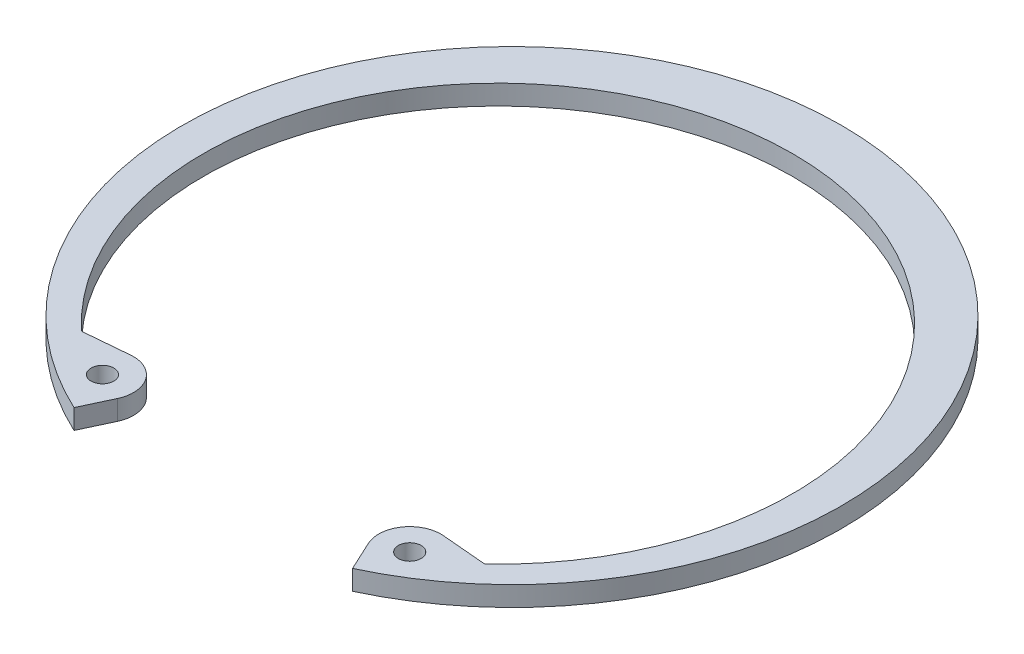
ISO-10303-21;
HEADER;
FILE_DESCRIPTION(('STEP AP214'),'2;1');
FILE_NAME('part.step','',(''),(''),'','','');
FILE_SCHEMA(('AUTOMOTIVE_DESIGN { 1 0 10303 214 1 1 1 1 }'));
ENDSEC;
DATA;
#1=APPLICATION_CONTEXT('core data for automotive mechanical design processes');
#2=APPLICATION_PROTOCOL_DEFINITION('international standard','automotive_design',2000,#1);
#3=PRODUCT_CONTEXT('',#1,'mechanical');
#4=PRODUCT('Part','Part','',(#3));
#5=PRODUCT_RELATED_PRODUCT_CATEGORY('part','',(#4));
#6=PRODUCT_DEFINITION_FORMATION('','',#4);
#7=PRODUCT_DEFINITION_CONTEXT('part definition',#1,'design');
#8=PRODUCT_DEFINITION('design','',#6,#7);
#9=PRODUCT_DEFINITION_SHAPE('','',#8);
#10=(LENGTH_UNIT() NAMED_UNIT(*) SI_UNIT(.MILLI.,.METRE.));
#11=(NAMED_UNIT(*) PLANE_ANGLE_UNIT() SI_UNIT($,.RADIAN.));
#12=(NAMED_UNIT(*) SI_UNIT($,.STERADIAN.) SOLID_ANGLE_UNIT());
#13=UNCERTAINTY_MEASURE_WITH_UNIT(LENGTH_MEASURE(1.E-05),#10,'distance_accuracy_value','');
#14=(GEOMETRIC_REPRESENTATION_CONTEXT(3) GLOBAL_UNCERTAINTY_ASSIGNED_CONTEXT((#13)) GLOBAL_UNIT_ASSIGNED_CONTEXT((#10,
#11,#12)) REPRESENTATION_CONTEXT('',''));
#15=CARTESIAN_POINT('',(0.,0.,0.));
#16=DIRECTION('',(0.,0.,1.));
#17=DIRECTION('',(1.,0.,0.));
#18=AXIS2_PLACEMENT_3D('',#15,#16,#17);
#19=CARTESIAN_POINT('',(21.450481238733,-2.7686,35.7233455084594));
#20=DIRECTION('',(0.,1.,0.));
#21=DIRECTION('',(0.,0.,1.));
#22=AXIS2_PLACEMENT_3D('',#19,#20,#21);
#23=CYLINDRICAL_SURFACE('',#22,4.3434);
#24=CARTESIAN_POINT('',(21.450481238733,0.,35.7233455084594));
#25=DIRECTION('',(0.,1.,0.));
#26=DIRECTION('',(0.,0.,-1.));
#27=AXIS2_PLACEMENT_3D('',#24,#25,#26);
#28=CIRCLE('',#27,4.3434);
#29=CARTESIAN_POINT('',(21.8290334917832,0.,31.3964734567677));
#30=VERTEX_POINT('',#29);
#31=CARTESIAN_POINT('',(17.514023996518,0.,37.5589456665039));
#32=VERTEX_POINT('',#31);
#33=EDGE_CURVE('E160',#30,#32,#28,.T.);
#34=ORIENTED_EDGE('',*,*,#33,.F.);
#35=DIRECTION('',(0.,1.,0.));
#36=VECTOR('',#35,1.);
#37=CARTESIAN_POINT('',(21.8290334917832,-2.7686,31.3964734567677));
#38=LINE('',#37,#36);
#39=CARTESIAN_POINT('',(21.8290334917832,-2.7686,31.3964734567677));
#40=VERTEX_POINT('',#39);
#41=EDGE_CURVE('E137',#40,#30,#38,.T.);
#42=ORIENTED_EDGE('',*,*,#41,.F.);
#43=CARTESIAN_POINT('',(21.450481238733,-2.7686,35.7233455084594));
#44=DIRECTION('',(0.,1.,0.));
#45=DIRECTION('',(0.,0.,-1.));
#46=AXIS2_PLACEMENT_3D('',#43,#44,#45);
#47=CIRCLE('',#46,4.3434);
#48=CARTESIAN_POINT('',(17.514023996518,-2.7686,37.5589456665039));
#49=VERTEX_POINT('',#48);
#50=EDGE_CURVE('E130',#40,#49,#47,.T.);
#51=ORIENTED_EDGE('',*,*,#50,.T.);
#52=DIRECTION('',(0.,1.,0.));
#53=VECTOR('',#52,1.);
#54=CARTESIAN_POINT('',(17.514023996518,-2.7686,37.5589456665039));
#55=LINE('',#54,#53);
#56=EDGE_CURVE('E113',#49,#32,#55,.T.);
#57=ORIENTED_EDGE('',*,*,#56,.T.);
#58=EDGE_LOOP('',(#34,#42,#51,#57));
#59=FACE_BOUND('',#58,.T.);
#60=ADVANCED_FACE('F38',(#59),#23,.T.);
#61=CARTESIAN_POINT('',(28.1520717588371,-2.7686,31.9496676241755));
#62=DIRECTION('',(0.0871557427476625,0.,-0.996194698091745));
#63=DIRECTION('',(-0.996194698091745,0.,-0.0871557427476625));
#64=AXIS2_PLACEMENT_3D('',#61,#62,#63);
#65=PLANE('',#64);
#66=DIRECTION('',(-0.996194698091745,0.,-0.0871557427476625));
#67=VECTOR('',#66,1.);
#68=CARTESIAN_POINT('',(28.1520717588371,0.,31.9496676241755));
#69=LINE('',#68,#67);
#70=CARTESIAN_POINT('',(28.0387108014153,0.,31.9397498255147));
#71=VERTEX_POINT('',#70);
#72=EDGE_CURVE('E138',#71,#30,#69,.T.);
#73=ORIENTED_EDGE('',*,*,#72,.F.);
#74=DIRECTION('',(0.,-1.,0.));
#75=VECTOR('',#74,1.);
#76=CARTESIAN_POINT('',(28.0387108014153,-2.7686,31.9397498255147));
#77=LINE('',#76,#75);
#78=CARTESIAN_POINT('',(28.0387108014153,-2.7686,31.9397498255147));
#79=VERTEX_POINT('',#78);
#80=EDGE_CURVE('E53',#71,#79,#77,.T.);
#81=ORIENTED_EDGE('',*,*,#80,.T.);
#82=DIRECTION('',(-0.996194698091745,0.,-0.0871557427476625));
#83=VECTOR('',#82,1.);
#84=CARTESIAN_POINT('',(28.1520717588371,-2.7686,31.9496676241755));
#85=LINE('',#84,#83);
#86=EDGE_CURVE('E124',#79,#40,#85,.T.);
#87=ORIENTED_EDGE('',*,*,#86,.T.);
#88=ORIENTED_EDGE('',*,*,#41,.T.);
#89=EDGE_LOOP('',(#73,#81,#87,#88));
#90=FACE_BOUND('',#89,.T.);
#91=ADVANCED_FACE('F215',(#90),#65,.T.);
#92=CARTESIAN_POINT('',(0.,-2.7686,1.95621005176375));
#93=DIRECTION('',(0.,1.,0.));
#94=DIRECTION('',(0.,0.,1.));
#95=AXIS2_PLACEMENT_3D('',#92,#93,#94);
#96=CYLINDRICAL_SURFACE('',#95,41.1357100517638);
#97=CARTESIAN_POINT('',(0.,0.,1.95621005176375));
#98=DIRECTION('',(0.,-1.,0.));
#99=DIRECTION('',(0.,0.,1.));
#100=AXIS2_PLACEMENT_3D('',#97,#98,#99);
#101=CIRCLE('',#100,41.1357100517638);
#102=CARTESIAN_POINT('',(-28.2351917394091,0.,31.8714334154891));
#103=VERTEX_POINT('',#102);
#104=CARTESIAN_POINT('',(28.2351917394092,0.,31.8714334154891));
#105=VERTEX_POINT('',#104);
#106=EDGE_CURVE('E140',#103,#105,#101,.T.);
#107=ORIENTED_EDGE('',*,*,#106,.F.);
#108=DIRECTION('',(0.,1.,0.));
#109=VECTOR('',#108,1.);
#110=CARTESIAN_POINT('',(-28.2351917394091,-2.7686,31.8714334154891));
#111=LINE('',#110,#109);
#112=CARTESIAN_POINT('',(-28.2351917394091,-2.7686,31.8714334154891));
#113=VERTEX_POINT('',#112);
#114=EDGE_CURVE('E191',#103,#113,#111,.F.);
#115=ORIENTED_EDGE('',*,*,#114,.T.);
#116=CARTESIAN_POINT('',(0.,-2.7686,1.95621005176375));
#117=DIRECTION('',(0.,-1.,0.));
#118=DIRECTION('',(0.,0.,1.));
#119=AXIS2_PLACEMENT_3D('',#116,#117,#118);
#120=CIRCLE('',#119,41.1357100517638);
#121=CARTESIAN_POINT('',(28.2351917394092,-2.7686,31.8714334154891));
#122=VERTEX_POINT('',#121);
#123=EDGE_CURVE('E156',#113,#122,#120,.T.);
#124=ORIENTED_EDGE('',*,*,#123,.T.);
#125=DIRECTION('',(0.,1.,0.));
#126=VECTOR('',#125,1.);
#127=CARTESIAN_POINT('',(28.2351917394092,-2.7686,31.8714334154891));
#128=LINE('',#127,#126);
#129=EDGE_CURVE('E188',#122,#105,#128,.T.);
#130=ORIENTED_EDGE('',*,*,#129,.T.);
#131=EDGE_LOOP('',(#107,#115,#124,#130));
#132=FACE_BOUND('',#131,.T.);
#133=ADVANCED_FACE('F211',(#132),#96,.F.);
#134=CARTESIAN_POINT('',(-28.1520717588371,-2.7686,31.9496676241755));
#135=DIRECTION('',(-0.0871557427476549,0.,-0.996194698091746));
#136=DIRECTION('',(-0.996194698091746,0.,0.0871557427476549));
#137=AXIS2_PLACEMENT_3D('',#134,#135,#136);
#138=PLANE('',#137);
#139=DIRECTION('',(-0.996194698091746,0.,0.0871557427476549));
#140=VECTOR('',#139,1.);
#141=CARTESIAN_POINT('',(-28.1520717588371,-2.7686,31.9496676241755));
#142=LINE('',#141,#140);
#143=CARTESIAN_POINT('',(-21.8290334917832,-2.7686,31.3964734567677));
#144=VERTEX_POINT('',#143);
#145=CARTESIAN_POINT('',(-28.0387108014153,-2.7686,31.9397498255146));
#146=VERTEX_POINT('',#145);
#147=EDGE_CURVE('E153',#144,#146,#142,.T.);
#148=ORIENTED_EDGE('',*,*,#147,.T.);
#149=DIRECTION('',(0.,-1.,0.));
#150=VECTOR('',#149,1.);
#151=CARTESIAN_POINT('',(-28.0387108014153,0.,31.9397498255146));
#152=LINE('',#151,#150);
#153=CARTESIAN_POINT('',(-28.0387108014153,0.,31.9397498255146));
#154=VERTEX_POINT('',#153);
#155=EDGE_CURVE('E178',#146,#154,#152,.F.);
#156=ORIENTED_EDGE('',*,*,#155,.T.);
#157=DIRECTION('',(-0.996194698091746,0.,0.0871557427476549));
#158=VECTOR('',#157,1.);
#159=CARTESIAN_POINT('',(-28.1520717588371,0.,31.9496676241755));
#160=LINE('',#159,#158);
#161=CARTESIAN_POINT('',(-21.8290334917832,0.,31.3964734567677));
#162=VERTEX_POINT('',#161);
#163=EDGE_CURVE('E173',#162,#154,#160,.T.);
#164=ORIENTED_EDGE('',*,*,#163,.F.);
#165=DIRECTION('',(0.,1.,0.));
#166=VECTOR('',#165,1.);
#167=CARTESIAN_POINT('',(-21.8290334917832,-2.7686,31.3964734567677));
#168=LINE('',#167,#166);
#169=EDGE_CURVE('E179',#144,#162,#168,.T.);
#170=ORIENTED_EDGE('',*,*,#169,.F.);
#171=EDGE_LOOP('',(#148,#156,#164,#170));
#172=FACE_BOUND('',#171,.T.);
#173=ADVANCED_FACE('F205',(#172),#138,.T.);
#174=CARTESIAN_POINT('',(-21.450481238733,-2.7686,35.7233455084594));
#175=DIRECTION('',(0.,1.,0.));
#176=DIRECTION('',(0.,0.,1.));
#177=AXIS2_PLACEMENT_3D('',#174,#175,#176);
#178=CYLINDRICAL_SURFACE('',#177,4.3434);
#179=CARTESIAN_POINT('',(-21.450481238733,0.,35.7233455084594));
#180=DIRECTION('',(0.,1.,0.));
#181=DIRECTION('',(0.,0.,1.));
#182=AXIS2_PLACEMENT_3D('',#179,#180,#181);
#183=CIRCLE('',#182,4.3434);
#184=CARTESIAN_POINT('',(-17.514023996518,0.,37.5589456665039));
#185=VERTEX_POINT('',#184);
#186=EDGE_CURVE('E170',#185,#162,#183,.T.);
#187=ORIENTED_EDGE('',*,*,#186,.F.);
#188=DIRECTION('',(0.,1.,0.));
#189=VECTOR('',#188,1.);
#190=CARTESIAN_POINT('',(-17.514023996518,-2.7686,37.5589456665039));
#191=LINE('',#190,#189);
#192=CARTESIAN_POINT('',(-17.514023996518,-2.7686,37.5589456665039));
#193=VERTEX_POINT('',#192);
#194=EDGE_CURVE('E181',#193,#185,#191,.T.);
#195=ORIENTED_EDGE('',*,*,#194,.F.);
#196=CARTESIAN_POINT('',(-21.450481238733,-2.7686,35.7233455084594));
#197=DIRECTION('',(0.,1.,0.));
#198=DIRECTION('',(0.,0.,1.));
#199=AXIS2_PLACEMENT_3D('',#196,#197,#198);
#200=CIRCLE('',#199,4.3434);
#201=EDGE_CURVE('E150',#193,#144,#200,.T.);
#202=ORIENTED_EDGE('',*,*,#201,.T.);
#203=ORIENTED_EDGE('',*,*,#169,.T.);
#204=EDGE_LOOP('',(#187,#195,#202,#203));
#205=FACE_BOUND('',#204,.T.);
#206=ADVANCED_FACE('F224',(#205),#178,.T.);
#207=CARTESIAN_POINT('',(-19.445553721039,-2.7686,41.7011245279092));
#208=DIRECTION('',(0.906307787036652,0.,0.422618261740694));
#209=DIRECTION('',(0.422618261740694,0.,-0.906307787036652));
#210=AXIS2_PLACEMENT_3D('',#207,#208,#209);
#211=PLANE('',#210);
#212=DIRECTION('',(0.422618261740694,0.,-0.906307787036652));
#213=VECTOR('',#212,1.);
#214=CARTESIAN_POINT('',(-19.445553721039,0.,41.7011245279092));
#215=LINE('',#214,#213);
#216=CARTESIAN_POINT('',(-19.445553721039,0.,41.7011245279092));
#217=VERTEX_POINT('',#216);
#218=EDGE_CURVE('E167',#217,#185,#215,.T.);
#219=ORIENTED_EDGE('',*,*,#218,.F.);
#220=DIRECTION('',(0.,1.,0.));
#221=VECTOR('',#220,1.);
#222=CARTESIAN_POINT('',(-19.445553721039,-2.7686,41.7011245279092));
#223=LINE('',#222,#221);
#224=CARTESIAN_POINT('',(-19.445553721039,-2.7686,41.7011245279092));
#225=VERTEX_POINT('',#224);
#226=EDGE_CURVE('E183',#225,#217,#223,.T.);
#227=ORIENTED_EDGE('',*,*,#226,.F.);
#228=DIRECTION('',(0.422618261740694,0.,-0.906307787036652));
#229=VECTOR('',#228,1.);
#230=CARTESIAN_POINT('',(-19.445553721039,-2.7686,41.7011245279092));
#231=LINE('',#230,#229);
#232=EDGE_CURVE('E147',#225,#193,#231,.T.);
#233=ORIENTED_EDGE('',*,*,#232,.T.);
#234=ORIENTED_EDGE('',*,*,#194,.T.);
#235=EDGE_LOOP('',(#219,#227,#233,#234));
#236=FACE_BOUND('',#235,.T.);
#237=ADVANCED_FACE('F221',(#236),#211,.T.);
#238=CARTESIAN_POINT('',(0.,-2.7686,0.));
#239=DIRECTION('',(0.,1.,0.));
#240=DIRECTION('',(0.,0.,1.));
#241=AXIS2_PLACEMENT_3D('',#238,#239,#240);
#242=CYLINDRICAL_SURFACE('',#241,46.0121);
#243=CARTESIAN_POINT('',(0.,0.,0.));
#244=DIRECTION('',(0.,1.,0.));
#245=DIRECTION('',(0.,0.,1.));
#246=AXIS2_PLACEMENT_3D('',#243,#244,#245);
#247=CIRCLE('',#246,46.0121);
#248=CARTESIAN_POINT('',(19.445553721039,0.,41.7011245279092));
#249=VERTEX_POINT('',#248);
#250=EDGE_CURVE('E164',#249,#217,#247,.T.);
#251=ORIENTED_EDGE('',*,*,#250,.F.);
#252=DIRECTION('',(0.,1.,0.));
#253=VECTOR('',#252,1.);
#254=CARTESIAN_POINT('',(19.445553721039,-2.7686,41.7011245279092));
#255=LINE('',#254,#253);
#256=CARTESIAN_POINT('',(19.445553721039,-2.7686,41.7011245279092));
#257=VERTEX_POINT('',#256);
#258=EDGE_CURVE('E123',#257,#249,#255,.T.);
#259=ORIENTED_EDGE('',*,*,#258,.F.);
#260=CARTESIAN_POINT('',(0.,-2.7686,0.));
#261=DIRECTION('',(0.,1.,0.));
#262=DIRECTION('',(0.,0.,1.));
#263=AXIS2_PLACEMENT_3D('',#260,#261,#262);
#264=CIRCLE('',#263,46.0121);
#265=EDGE_CURVE('E133',#257,#225,#264,.T.);
#266=ORIENTED_EDGE('',*,*,#265,.T.);
#267=ORIENTED_EDGE('',*,*,#226,.T.);
#268=EDGE_LOOP('',(#251,#259,#266,#267));
#269=FACE_BOUND('',#268,.T.);
#270=ADVANCED_FACE('F219',(#269),#242,.T.);
#271=CARTESIAN_POINT('',(19.445553721039,-2.7686,41.7011245279092));
#272=DIRECTION('',(-0.906307787036652,0.,0.422618261740694));
#273=DIRECTION('',(0.422618261740694,0.,0.906307787036652));
#274=AXIS2_PLACEMENT_3D('',#271,#272,#273);
#275=PLANE('',#274);
#276=DIRECTION('',(0.422618261740694,0.,0.906307787036652));
#277=VECTOR('',#276,1.);
#278=CARTESIAN_POINT('',(19.445553721039,0.,41.7011245279092));
#279=LINE('',#278,#277);
#280=EDGE_CURVE('E118',#32,#249,#279,.T.);
#281=ORIENTED_EDGE('',*,*,#280,.F.);
#282=ORIENTED_EDGE('',*,*,#56,.F.);
#283=DIRECTION('',(0.422618261740694,0.,0.906307787036652));
#284=VECTOR('',#283,1.);
#285=CARTESIAN_POINT('',(19.445553721039,-2.7686,41.7011245279092));
#286=LINE('',#285,#284);
#287=EDGE_CURVE('E116',#49,#257,#286,.T.);
#288=ORIENTED_EDGE('',*,*,#287,.T.);
#289=ORIENTED_EDGE('',*,*,#258,.T.);
#290=EDGE_LOOP('',(#281,#282,#288,#289));
#291=FACE_BOUND('',#290,.T.);
#292=ADVANCED_FACE('F115',(#291),#275,.T.);
#293=CARTESIAN_POINT('',(21.450481238733,-2.7686,35.7233455084594));
#294=DIRECTION('',(0.,-1.,0.));
#295=DIRECTION('',(0.,0.,-1.));
#296=AXIS2_PLACEMENT_3D('',#293,#294,#295);
#297=PLANE('',#296);
#298=CARTESIAN_POINT('',(-21.450481238733,-2.7686,35.7233455084594));
#299=DIRECTION('',(0.,1.,0.));
#300=DIRECTION('',(0.,0.,1.));
#301=AXIS2_PLACEMENT_3D('',#298,#299,#300);
#302=CIRCLE('',#301,1.5875);
#303=CARTESIAN_POINT('',(-21.450481238733,-2.7686,37.3108455084594));
#304=VERTEX_POINT('',#303);
#305=EDGE_CURVE('E368',#304,#304,#302,.T.);
#306=ORIENTED_EDGE('',*,*,#305,.T.);
#307=EDGE_LOOP('',(#306));
#308=FACE_BOUND('',#307,.T.);
#309=CARTESIAN_POINT('',(21.450481238733,-2.7686,35.7233455084594));
#310=DIRECTION('',(0.,1.,0.));
#311=DIRECTION('',(0.,0.,1.));
#312=AXIS2_PLACEMENT_3D('',#309,#310,#311);
#313=CIRCLE('',#312,1.5875);
#314=CARTESIAN_POINT('',(21.450481238733,-2.7686,37.3108455084594));
#315=VERTEX_POINT('',#314);
#316=EDGE_CURVE('E162',#315,#315,#313,.T.);
#317=ORIENTED_EDGE('',*,*,#316,.T.);
#318=EDGE_LOOP('',(#317));
#319=FACE_BOUND('',#318,.T.);
#320=ORIENTED_EDGE('',*,*,#50,.F.);
#321=ORIENTED_EDGE('',*,*,#86,.F.);
#322=CARTESIAN_POINT('',(28.0608483600732,-2.7686,31.6867163721994));
#323=DIRECTION('',(0.,-1.,0.));
#324=DIRECTION('',(0.,0.,-1.));
#325=AXIS2_PLACEMENT_3D('',#322,#323,#324);
#326=CIRCLE('',#325,0.254);
#327=EDGE_CURVE('E11',#79,#122,#326,.F.);
#328=ORIENTED_EDGE('',*,*,#327,.T.);
#329=ORIENTED_EDGE('',*,*,#123,.F.);
#330=CARTESIAN_POINT('',(-28.0608483600732,-2.7686,31.6867163721993));
#331=DIRECTION('',(0.,-1.,0.));
#332=DIRECTION('',(0.,0.,-1.));
#333=AXIS2_PLACEMENT_3D('',#330,#331,#332);
#334=CIRCLE('',#333,0.254);
#335=EDGE_CURVE('E196',#113,#146,#334,.F.);
#336=ORIENTED_EDGE('',*,*,#335,.T.);
#337=ORIENTED_EDGE('',*,*,#147,.F.);
#338=ORIENTED_EDGE('',*,*,#201,.F.);
#339=ORIENTED_EDGE('',*,*,#232,.F.);
#340=ORIENTED_EDGE('',*,*,#265,.F.);
#341=ORIENTED_EDGE('',*,*,#287,.F.);
#342=EDGE_LOOP('',(#320,#321,#328,#329,#336,#337,#338,#339,#340,#341));
#343=FACE_BOUND('',#342,.T.);
#344=ADVANCED_FACE('F129',(#308,#319,#343),#297,.T.);
#345=CARTESIAN_POINT('',(21.450481238733,0.,35.7233455084594));
#346=DIRECTION('',(0.,-1.,0.));
#347=DIRECTION('',(0.,0.,-1.));
#348=AXIS2_PLACEMENT_3D('',#345,#346,#347);
#349=PLANE('',#348);
#350=CARTESIAN_POINT('',(-21.450481238733,0.,35.7233455084594));
#351=DIRECTION('',(0.,1.,0.));
#352=DIRECTION('',(0.,0.,1.));
#353=AXIS2_PLACEMENT_3D('',#350,#351,#352);
#354=CIRCLE('',#353,1.5875);
#355=CARTESIAN_POINT('',(-21.450481238733,0.,37.3108455084594));
#356=VERTEX_POINT('',#355);
#357=EDGE_CURVE('E364',#356,#356,#354,.T.);
#358=ORIENTED_EDGE('',*,*,#357,.F.);
#359=EDGE_LOOP('',(#358));
#360=FACE_BOUND('',#359,.T.);
#361=CARTESIAN_POINT('',(21.450481238733,0.,35.7233455084594));
#362=DIRECTION('',(0.,1.,0.));
#363=DIRECTION('',(0.,0.,1.));
#364=AXIS2_PLACEMENT_3D('',#361,#362,#363);
#365=CIRCLE('',#364,1.5875);
#366=CARTESIAN_POINT('',(21.450481238733,0.,37.3108455084594));
#367=VERTEX_POINT('',#366);
#368=EDGE_CURVE('E143',#367,#367,#365,.T.);
#369=ORIENTED_EDGE('',*,*,#368,.F.);
#370=EDGE_LOOP('',(#369));
#371=FACE_BOUND('',#370,.T.);
#372=ORIENTED_EDGE('',*,*,#33,.T.);
#373=ORIENTED_EDGE('',*,*,#280,.T.);
#374=ORIENTED_EDGE('',*,*,#250,.T.);
#375=ORIENTED_EDGE('',*,*,#218,.T.);
#376=ORIENTED_EDGE('',*,*,#186,.T.);
#377=ORIENTED_EDGE('',*,*,#163,.T.);
#378=CARTESIAN_POINT('',(-28.0608483600732,0.,31.6867163721993));
#379=DIRECTION('',(0.,-1.,0.));
#380=DIRECTION('',(0.,0.,-1.));
#381=AXIS2_PLACEMENT_3D('',#378,#379,#380);
#382=CIRCLE('',#381,0.254);
#383=EDGE_CURVE('E194',#154,#103,#382,.T.);
#384=ORIENTED_EDGE('',*,*,#383,.T.);
#385=ORIENTED_EDGE('',*,*,#106,.T.);
#386=CARTESIAN_POINT('',(28.0608483600732,0.,31.6867163721994));
#387=DIRECTION('',(0.,-1.,0.));
#388=DIRECTION('',(0.,0.,-1.));
#389=AXIS2_PLACEMENT_3D('',#386,#387,#388);
#390=CIRCLE('',#389,0.254);
#391=EDGE_CURVE('E46',#105,#71,#390,.T.);
#392=ORIENTED_EDGE('',*,*,#391,.T.);
#393=ORIENTED_EDGE('',*,*,#72,.T.);
#394=EDGE_LOOP('',(#372,#373,#374,#375,#376,#377,#384,#385,#392,#393));
#395=FACE_BOUND('',#394,.T.);
#396=ADVANCED_FACE('F209',(#360,#371,#395),#349,.F.);
#397=CARTESIAN_POINT('',(21.450481238733,-2.7686,35.7233455084594));
#398=DIRECTION('',(0.,1.,0.));
#399=DIRECTION('',(0.,0.,1.));
#400=AXIS2_PLACEMENT_3D('',#397,#398,#399);
#401=CYLINDRICAL_SURFACE('',#400,1.5875);
#402=ORIENTED_EDGE('',*,*,#316,.F.);
#403=EDGE_LOOP('',(#402));
#404=FACE_BOUND('',#403,.T.);
#405=ORIENTED_EDGE('',*,*,#368,.T.);
#406=EDGE_LOOP('',(#405));
#407=FACE_BOUND('',#406,.T.);
#408=ADVANCED_FACE('F247',(#404,#407),#401,.F.);
#409=CARTESIAN_POINT('',(-21.450481238733,-2.7686,35.7233455084594));
#410=DIRECTION('',(0.,1.,0.));
#411=DIRECTION('',(0.,0.,1.));
#412=AXIS2_PLACEMENT_3D('',#409,#410,#411);
#413=CYLINDRICAL_SURFACE('',#412,1.5875);
#414=ORIENTED_EDGE('',*,*,#305,.F.);
#415=EDGE_LOOP('',(#414));
#416=FACE_BOUND('',#415,.T.);
#417=ORIENTED_EDGE('',*,*,#357,.T.);
#418=EDGE_LOOP('',(#417));
#419=FACE_BOUND('',#418,.T.);
#420=ADVANCED_FACE('F242',(#416,#419),#413,.F.);
#421=CARTESIAN_POINT('',(-28.0608483600732,-2.7686,31.6867163721993));
#422=DIRECTION('',(0.,1.,0.));
#423=DIRECTION('',(0.,0.,1.));
#424=AXIS2_PLACEMENT_3D('',#421,#422,#423);
#425=CYLINDRICAL_SURFACE('',#424,0.254);
#426=ORIENTED_EDGE('',*,*,#335,.F.);
#427=ORIENTED_EDGE('',*,*,#114,.F.);
#428=ORIENTED_EDGE('',*,*,#383,.F.);
#429=ORIENTED_EDGE('',*,*,#155,.F.);
#430=EDGE_LOOP('',(#426,#427,#428,#429));
#431=FACE_BOUND('',#430,.T.);
#432=ADVANCED_FACE('F207',(#431),#425,.F.);
#433=CARTESIAN_POINT('',(28.0608483600732,-2.7686,31.6867163721994));
#434=DIRECTION('',(0.,1.,0.));
#435=DIRECTION('',(0.,0.,1.));
#436=AXIS2_PLACEMENT_3D('',#433,#434,#435);
#437=CYLINDRICAL_SURFACE('',#436,0.254);
#438=ORIENTED_EDGE('',*,*,#327,.F.);
#439=ORIENTED_EDGE('',*,*,#80,.F.);
#440=ORIENTED_EDGE('',*,*,#391,.F.);
#441=ORIENTED_EDGE('',*,*,#129,.F.);
#442=EDGE_LOOP('',(#438,#439,#440,#441));
#443=FACE_BOUND('',#442,.T.);
#444=ADVANCED_FACE('F40',(#443),#437,.F.);
#445=CLOSED_SHELL('',(#60,#91,#133,#173,#206,#237,#270,#292,#344,#396,#408,#420,#432,#444));
#446=MANIFOLD_SOLID_BREP('B2',#445);
#447=ADVANCED_BREP_SHAPE_REPRESENTATION('',(#18,#446),#14);
#448=SHAPE_DEFINITION_REPRESENTATION(#9,#447);
ENDSEC;
END-ISO-10303-21;
